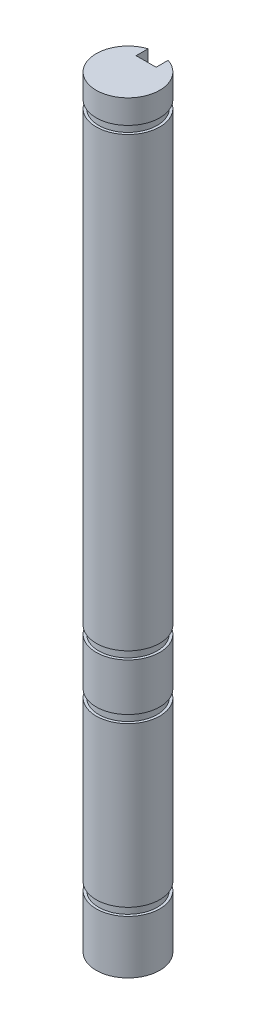
ISO-10303-21;
HEADER;
FILE_DESCRIPTION(('STEP AP214'),'2;1');
FILE_NAME('part.step','',(''),(''),'','','');
FILE_SCHEMA(('AUTOMOTIVE_DESIGN { 1 0 10303 214 1 1 1 1 }'));
ENDSEC;
DATA;
#1=APPLICATION_CONTEXT('core data for automotive mechanical design processes');
#2=APPLICATION_PROTOCOL_DEFINITION('international standard','automotive_design',2000,#1);
#3=PRODUCT_CONTEXT('',#1,'mechanical');
#4=PRODUCT('Part','Part','',(#3));
#5=PRODUCT_RELATED_PRODUCT_CATEGORY('part','',(#4));
#6=PRODUCT_DEFINITION_FORMATION('','',#4);
#7=PRODUCT_DEFINITION_CONTEXT('part definition',#1,'design');
#8=PRODUCT_DEFINITION('design','',#6,#7);
#9=PRODUCT_DEFINITION_SHAPE('','',#8);
#10=(LENGTH_UNIT() NAMED_UNIT(*) SI_UNIT(.MILLI.,.METRE.));
#11=(NAMED_UNIT(*) PLANE_ANGLE_UNIT() SI_UNIT($,.RADIAN.));
#12=(NAMED_UNIT(*) SI_UNIT($,.STERADIAN.) SOLID_ANGLE_UNIT());
#13=UNCERTAINTY_MEASURE_WITH_UNIT(LENGTH_MEASURE(1.E-05),#10,'distance_accuracy_value','');
#14=(GEOMETRIC_REPRESENTATION_CONTEXT(3) GLOBAL_UNCERTAINTY_ASSIGNED_CONTEXT((#13)) GLOBAL_UNIT_ASSIGNED_CONTEXT((#10,
#11,#12)) REPRESENTATION_CONTEXT('',''));
#15=CARTESIAN_POINT('',(0.,0.,0.));
#16=DIRECTION('',(0.,0.,1.));
#17=DIRECTION('',(1.,0.,0.));
#18=AXIS2_PLACEMENT_3D('',#15,#16,#17);
#19=CARTESIAN_POINT('',(0.,76.2,0.));
#20=DIRECTION('',(0.,-1.,0.));
#21=DIRECTION('',(0.,0.,-1.));
#22=AXIS2_PLACEMENT_3D('',#19,#20,#21);
#23=CYLINDRICAL_SURFACE('',#22,3.175);
#24=CARTESIAN_POINT('',(0.,6.1214,0.));
#25=DIRECTION('',(0.,-1.,0.));
#26=DIRECTION('',(0.,0.,-1.));
#27=AXIS2_PLACEMENT_3D('',#24,#25,#26);
#28=CIRCLE('',#27,3.175);
#29=CARTESIAN_POINT('',(0.999999999999999,6.1214,-3.01340753964677));
#30=VERTEX_POINT('',#29);
#31=CARTESIAN_POINT('',(-1.,6.1214,-3.01340753964677));
#32=VERTEX_POINT('',#31);
#33=EDGE_CURVE('E186',#30,#32,#28,.T.);
#34=ORIENTED_EDGE('',*,*,#33,.F.);
#35=DIRECTION('',(0.,-1.,0.));
#36=VECTOR('',#35,1.);
#37=CARTESIAN_POINT('',(1.,76.2,-3.01340753964677));
#38=LINE('',#37,#36);
#39=CARTESIAN_POINT('',(0.999999999999999,22.0218,-3.01340753964677));
#40=VERTEX_POINT('',#39);
#41=EDGE_CURVE('E323',#40,#30,#38,.T.);
#42=ORIENTED_EDGE('',*,*,#41,.F.);
#43=CARTESIAN_POINT('',(0.,22.0218,0.));
#44=DIRECTION('',(0.,-1.,0.));
#45=DIRECTION('',(0.,0.,-1.));
#46=AXIS2_PLACEMENT_3D('',#43,#44,#45);
#47=CIRCLE('',#46,3.175);
#48=CARTESIAN_POINT('',(-1.,22.0218,-3.01340753964677));
#49=VERTEX_POINT('',#48);
#50=EDGE_CURVE('E201',#40,#49,#47,.T.);
#51=ORIENTED_EDGE('',*,*,#50,.T.);
#52=DIRECTION('',(0.,-1.,0.));
#53=VECTOR('',#52,1.);
#54=CARTESIAN_POINT('',(-1.,76.2,-3.01340753964677));
#55=LINE('',#54,#53);
#56=EDGE_CURVE('E363',#49,#32,#55,.T.);
#57=ORIENTED_EDGE('',*,*,#56,.T.);
#58=EDGE_LOOP('',(#34,#42,#51,#57));
#59=FACE_BOUND('',#58,.T.);
#60=ADVANCED_FACE('F34',(#59),#23,.T.);
#61=CARTESIAN_POINT('',(0.,22.8092,0.));
#62=DIRECTION('',(0.,-1.,0.));
#63=DIRECTION('',(0.,0.,-1.));
#64=AXIS2_PLACEMENT_3D('',#61,#62,#63);
#65=CIRCLE('',#64,3.175);
#66=CARTESIAN_POINT('',(0.999999999999999,22.8092,-3.01340753964677));
#67=VERTEX_POINT('',#66);
#68=CARTESIAN_POINT('',(-1.,22.8092,-3.01340753964677));
#69=VERTEX_POINT('',#68);
#70=EDGE_CURVE('E199',#67,#69,#65,.T.);
#71=ORIENTED_EDGE('',*,*,#70,.F.);
#72=CARTESIAN_POINT('',(0.999999999999999,27.5336,-3.01340753964677));
#73=VERTEX_POINT('',#72);
#74=EDGE_CURVE('E324',#73,#67,#38,.T.);
#75=ORIENTED_EDGE('',*,*,#74,.F.);
#76=CARTESIAN_POINT('',(0.,27.5336,0.));
#77=DIRECTION('',(0.,-1.,0.));
#78=DIRECTION('',(0.,0.,-1.));
#79=AXIS2_PLACEMENT_3D('',#76,#77,#78);
#80=CIRCLE('',#79,3.175);
#81=CARTESIAN_POINT('',(-1.,27.5336,-3.01340753964677));
#82=VERTEX_POINT('',#81);
#83=EDGE_CURVE('E219',#73,#82,#80,.T.);
#84=ORIENTED_EDGE('',*,*,#83,.T.);
#85=EDGE_CURVE('E354',#82,#69,#55,.T.);
#86=ORIENTED_EDGE('',*,*,#85,.T.);
#87=EDGE_LOOP('',(#71,#75,#84,#86));
#88=FACE_BOUND('',#87,.T.);
#89=ADVANCED_FACE('F352',(#88),#23,.T.);
#90=CARTESIAN_POINT('',(0.,28.321,0.));
#91=DIRECTION('',(0.,-1.,0.));
#92=DIRECTION('',(0.,0.,-1.));
#93=AXIS2_PLACEMENT_3D('',#90,#91,#92);
#94=CIRCLE('',#93,3.175);
#95=CARTESIAN_POINT('',(0.999999999999999,28.321,-3.01340753964677));
#96=VERTEX_POINT('',#95);
#97=CARTESIAN_POINT('',(-1.,28.321,-3.01340753964677));
#98=VERTEX_POINT('',#97);
#99=EDGE_CURVE('E217',#96,#98,#94,.T.);
#100=ORIENTED_EDGE('',*,*,#99,.F.);
#101=CARTESIAN_POINT('',(0.999999999999999,73.025,-3.01340753964677));
#102=VERTEX_POINT('',#101);
#103=EDGE_CURVE('E285',#102,#96,#38,.T.);
#104=ORIENTED_EDGE('',*,*,#103,.F.);
#105=CARTESIAN_POINT('',(0.,73.025,0.));
#106=DIRECTION('',(0.,1.,0.));
#107=DIRECTION('',(0.,0.,1.));
#108=AXIS2_PLACEMENT_3D('',#105,#106,#107);
#109=CIRCLE('',#108,3.175);
#110=CARTESIAN_POINT('',(-1.,73.025,-3.01340753964677));
#111=VERTEX_POINT('',#110);
#112=EDGE_CURVE('E235',#111,#102,#109,.T.);
#113=ORIENTED_EDGE('',*,*,#112,.F.);
#114=EDGE_CURVE('E274',#111,#98,#55,.T.);
#115=ORIENTED_EDGE('',*,*,#114,.T.);
#116=EDGE_LOOP('',(#100,#104,#113,#115));
#117=FACE_BOUND('',#116,.T.);
#118=ADVANCED_FACE('F336',(#117),#23,.T.);
#119=CARTESIAN_POINT('',(0.999999999999999,5.334,-3.01340753964677));
#120=VERTEX_POINT('',#119);
#121=CARTESIAN_POINT('',(1.,0.,-3.01340753964677));
#122=VERTEX_POINT('',#121);
#123=EDGE_CURVE('E280',#120,#122,#38,.T.);
#124=ORIENTED_EDGE('',*,*,#123,.F.);
#125=CARTESIAN_POINT('',(0.,5.334,0.));
#126=DIRECTION('',(0.,-1.,0.));
#127=DIRECTION('',(0.,0.,-1.));
#128=AXIS2_PLACEMENT_3D('',#125,#126,#127);
#129=CIRCLE('',#128,3.175);
#130=CARTESIAN_POINT('',(-1.,5.334,-3.01340753964677));
#131=VERTEX_POINT('',#130);
#132=EDGE_CURVE('E176',#120,#131,#129,.T.);
#133=ORIENTED_EDGE('',*,*,#132,.T.);
#134=CARTESIAN_POINT('',(-1.,0.,-3.01340753964677));
#135=VERTEX_POINT('',#134);
#136=EDGE_CURVE('E261',#131,#135,#55,.T.);
#137=ORIENTED_EDGE('',*,*,#136,.T.);
#138=CARTESIAN_POINT('',(0.,0.,0.));
#139=DIRECTION('',(0.,1.,0.));
#140=DIRECTION('',(0.,0.,1.));
#141=AXIS2_PLACEMENT_3D('',#138,#139,#140);
#142=CIRCLE('',#141,3.175);
#143=EDGE_CURVE('E250',#135,#122,#142,.T.);
#144=ORIENTED_EDGE('',*,*,#143,.T.);
#145=EDGE_LOOP('',(#124,#133,#137,#144));
#146=FACE_BOUND('',#145,.T.);
#147=ADVANCED_FACE('F320',(#146),#23,.T.);
#148=CARTESIAN_POINT('',(-1.,76.2,-3.01340753964677));
#149=VERTEX_POINT('',#148);
#150=CARTESIAN_POINT('',(-1.,73.8124,-3.01340753964677));
#151=VERTEX_POINT('',#150);
#152=EDGE_CURVE('E270',#149,#151,#55,.T.);
#153=ORIENTED_EDGE('',*,*,#152,.T.);
#154=CARTESIAN_POINT('',(0.,73.8124,0.));
#155=DIRECTION('',(0.,1.,0.));
#156=DIRECTION('',(0.,0.,1.));
#157=AXIS2_PLACEMENT_3D('',#154,#155,#156);
#158=CIRCLE('',#157,3.175);
#159=CARTESIAN_POINT('',(0.999999999999999,73.8124,-3.01340753964677));
#160=VERTEX_POINT('',#159);
#161=EDGE_CURVE('E238',#151,#160,#158,.T.);
#162=ORIENTED_EDGE('',*,*,#161,.T.);
#163=CARTESIAN_POINT('',(1.,76.2,-3.01340753964677));
#164=VERTEX_POINT('',#163);
#165=EDGE_CURVE('E281',#164,#160,#38,.T.);
#166=ORIENTED_EDGE('',*,*,#165,.F.);
#167=CARTESIAN_POINT('',(0.,76.2,0.));
#168=DIRECTION('',(0.,1.,0.));
#169=DIRECTION('',(0.,0.,1.));
#170=AXIS2_PLACEMENT_3D('',#167,#168,#169);
#171=CIRCLE('',#170,3.175);
#172=EDGE_CURVE('E251',#149,#164,#171,.T.);
#173=ORIENTED_EDGE('',*,*,#172,.F.);
#174=EDGE_LOOP('',(#153,#162,#166,#173));
#175=FACE_BOUND('',#174,.T.);
#176=ADVANCED_FACE('F36',(#175),#23,.T.);
#177=CARTESIAN_POINT('',(1.,76.2,-1.81340753964677));
#178=DIRECTION('',(1.,0.,0.));
#179=DIRECTION('',(0.,0.,-1.));
#180=AXIS2_PLACEMENT_3D('',#177,#178,#179);
#181=PLANE('',#180);
#182=DIRECTION('',(0.,1.,0.));
#183=VECTOR('',#182,1.);
#184=CARTESIAN_POINT('',(0.999999999999999,5.334,-2.74449284932572));
#185=LINE('',#184,#183);
#186=CARTESIAN_POINT('',(1.,6.1214,-2.74449284932572));
#187=VERTEX_POINT('',#186);
#188=CARTESIAN_POINT('',(1.,5.334,-2.74449284932572));
#189=VERTEX_POINT('',#188);
#190=EDGE_CURVE('E183',#187,#189,#185,.F.);
#191=ORIENTED_EDGE('',*,*,#190,.T.);
#192=DIRECTION('',(0.,0.,-1.));
#193=VECTOR('',#192,1.);
#194=CARTESIAN_POINT('',(1.,5.334,-1.81340753964677));
#195=LINE('',#194,#193);
#196=EDGE_CURVE('E171',#189,#120,#195,.T.);
#197=ORIENTED_EDGE('',*,*,#196,.T.);
#198=ORIENTED_EDGE('',*,*,#123,.T.);
#199=DIRECTION('',(0.,0.,1.));
#200=VECTOR('',#199,1.);
#201=CARTESIAN_POINT('',(1.,0.,-1.81340753964677));
#202=LINE('',#201,#200);
#203=CARTESIAN_POINT('',(1.,0.,-1.81340753964677));
#204=VERTEX_POINT('',#203);
#205=EDGE_CURVE('E264',#122,#204,#202,.T.);
#206=ORIENTED_EDGE('',*,*,#205,.T.);
#207=DIRECTION('',(0.,-1.,0.));
#208=VECTOR('',#207,1.);
#209=CARTESIAN_POINT('',(1.,76.2,-1.81340753964677));
#210=LINE('',#209,#208);
#211=CARTESIAN_POINT('',(1.,76.2,-1.81340753964677));
#212=VERTEX_POINT('',#211);
#213=EDGE_CURVE('E277',#212,#204,#210,.T.);
#214=ORIENTED_EDGE('',*,*,#213,.F.);
#215=DIRECTION('',(0.,0.,1.));
#216=VECTOR('',#215,1.);
#217=CARTESIAN_POINT('',(1.,76.2,-1.81340753964677));
#218=LINE('',#217,#216);
#219=EDGE_CURVE('E254',#164,#212,#218,.T.);
#220=ORIENTED_EDGE('',*,*,#219,.F.);
#221=ORIENTED_EDGE('',*,*,#165,.T.);
#222=DIRECTION('',(0.,0.,1.));
#223=VECTOR('',#222,1.);
#224=CARTESIAN_POINT('',(1.,73.8124,-1.81340753964677));
#225=LINE('',#224,#223);
#226=CARTESIAN_POINT('',(1.,73.8124,-2.74449284932572));
#227=VERTEX_POINT('',#226);
#228=EDGE_CURVE('E247',#160,#227,#225,.T.);
#229=ORIENTED_EDGE('',*,*,#228,.T.);
#230=DIRECTION('',(0.,-1.,0.));
#231=VECTOR('',#230,1.);
#232=CARTESIAN_POINT('',(0.999999999999999,73.8124,-2.74449284932572));
#233=LINE('',#232,#231);
#234=CARTESIAN_POINT('',(1.,73.025,-2.74449284932572));
#235=VERTEX_POINT('',#234);
#236=EDGE_CURVE('E241',#227,#235,#233,.T.);
#237=ORIENTED_EDGE('',*,*,#236,.T.);
#238=DIRECTION('',(0.,0.,1.));
#239=VECTOR('',#238,1.);
#240=CARTESIAN_POINT('',(1.,73.025,-1.81340753964677));
#241=LINE('',#240,#239);
#242=EDGE_CURVE('E245',#102,#235,#241,.T.);
#243=ORIENTED_EDGE('',*,*,#242,.F.);
#244=ORIENTED_EDGE('',*,*,#103,.T.);
#245=DIRECTION('',(0.,0.,-1.));
#246=VECTOR('',#245,1.);
#247=CARTESIAN_POINT('',(1.,28.321,-1.81340753964677));
#248=LINE('',#247,#246);
#249=CARTESIAN_POINT('',(1.,28.321,-2.74449284932572));
#250=VERTEX_POINT('',#249);
#251=EDGE_CURVE('E226',#250,#96,#248,.T.);
#252=ORIENTED_EDGE('',*,*,#251,.F.);
#253=DIRECTION('',(0.,1.,0.));
#254=VECTOR('',#253,1.);
#255=CARTESIAN_POINT('',(0.999999999999999,27.5336,-2.74449284932572));
#256=LINE('',#255,#254);
#257=CARTESIAN_POINT('',(1.,27.5336,-2.74449284932572));
#258=VERTEX_POINT('',#257);
#259=EDGE_CURVE('E222',#250,#258,#256,.F.);
#260=ORIENTED_EDGE('',*,*,#259,.T.);
#261=DIRECTION('',(0.,0.,-1.));
#262=VECTOR('',#261,1.);
#263=CARTESIAN_POINT('',(1.,27.5336,-1.81340753964677));
#264=LINE('',#263,#262);
#265=EDGE_CURVE('E228',#258,#73,#264,.T.);
#266=ORIENTED_EDGE('',*,*,#265,.T.);
#267=ORIENTED_EDGE('',*,*,#74,.T.);
#268=DIRECTION('',(0.,0.,-1.));
#269=VECTOR('',#268,1.);
#270=CARTESIAN_POINT('',(1.,22.8092,-1.81340753964677));
#271=LINE('',#270,#269);
#272=CARTESIAN_POINT('',(1.,22.8092,-2.74449284932572));
#273=VERTEX_POINT('',#272);
#274=EDGE_CURVE('E208',#273,#67,#271,.T.);
#275=ORIENTED_EDGE('',*,*,#274,.F.);
#276=DIRECTION('',(0.,1.,0.));
#277=VECTOR('',#276,1.);
#278=CARTESIAN_POINT('',(0.999999999999999,22.0218,-2.74449284932572));
#279=LINE('',#278,#277);
#280=CARTESIAN_POINT('',(1.,22.0218,-2.74449284932572));
#281=VERTEX_POINT('',#280);
#282=EDGE_CURVE('E204',#273,#281,#279,.F.);
#283=ORIENTED_EDGE('',*,*,#282,.T.);
#284=DIRECTION('',(0.,0.,-1.));
#285=VECTOR('',#284,1.);
#286=CARTESIAN_POINT('',(1.,22.0218,-1.81340753964677));
#287=LINE('',#286,#285);
#288=EDGE_CURVE('E210',#281,#40,#287,.T.);
#289=ORIENTED_EDGE('',*,*,#288,.T.);
#290=ORIENTED_EDGE('',*,*,#41,.T.);
#291=DIRECTION('',(0.,0.,-1.));
#292=VECTOR('',#291,1.);
#293=CARTESIAN_POINT('',(1.,6.1214,-1.81340753964677));
#294=LINE('',#293,#292);
#295=EDGE_CURVE('E180',#187,#30,#294,.T.);
#296=ORIENTED_EDGE('',*,*,#295,.F.);
#297=EDGE_LOOP('',(#191,#197,#198,#206,#214,#220,#221,#229,#237,#243,#244,#252,#260,#266,#267,
#275,#283,#289,#290,#296));
#298=FACE_BOUND('',#297,.T.);
#299=ADVANCED_FACE('F189',(#298),#181,.F.);
#300=CARTESIAN_POINT('',(-1.,76.2,-1.81340753964677));
#301=DIRECTION('',(0.,0.,1.));
#302=DIRECTION('',(1.,0.,0.));
#303=AXIS2_PLACEMENT_3D('',#300,#301,#302);
#304=PLANE('',#303);
#305=DIRECTION('',(-1.,0.,0.));
#306=VECTOR('',#305,1.);
#307=CARTESIAN_POINT('',(-1.,0.,-1.81340753964677));
#308=LINE('',#307,#306);
#309=CARTESIAN_POINT('',(-1.,0.,-1.81340753964677));
#310=VERTEX_POINT('',#309);
#311=EDGE_CURVE('E266',#204,#310,#308,.T.);
#312=ORIENTED_EDGE('',*,*,#311,.T.);
#313=DIRECTION('',(0.,-1.,0.));
#314=VECTOR('',#313,1.);
#315=CARTESIAN_POINT('',(-1.,76.2,-1.81340753964677));
#316=LINE('',#315,#314);
#317=CARTESIAN_POINT('',(-1.,76.2,-1.81340753964677));
#318=VERTEX_POINT('',#317);
#319=EDGE_CURVE('E273',#318,#310,#316,.T.);
#320=ORIENTED_EDGE('',*,*,#319,.F.);
#321=DIRECTION('',(-1.,0.,0.));
#322=VECTOR('',#321,1.);
#323=CARTESIAN_POINT('',(-1.,76.2,-1.81340753964677));
#324=LINE('',#323,#322);
#325=EDGE_CURVE('E257',#212,#318,#324,.T.);
#326=ORIENTED_EDGE('',*,*,#325,.F.);
#327=ORIENTED_EDGE('',*,*,#213,.T.);
#328=EDGE_LOOP('',(#312,#320,#326,#327));
#329=FACE_BOUND('',#328,.T.);
#330=ADVANCED_FACE('F374',(#329),#304,.F.);
#331=CARTESIAN_POINT('',(-1.,76.2,-3.01340753964677));
#332=DIRECTION('',(-1.,0.,0.));
#333=DIRECTION('',(0.,0.,1.));
#334=AXIS2_PLACEMENT_3D('',#331,#332,#333);
#335=PLANE('',#334);
#336=ORIENTED_EDGE('',*,*,#136,.F.);
#337=DIRECTION('',(0.,0.,1.));
#338=VECTOR('',#337,1.);
#339=CARTESIAN_POINT('',(-1.,5.334,-3.01340753964677));
#340=LINE('',#339,#338);
#341=CARTESIAN_POINT('',(-1.,5.334,-2.74449284932572));
#342=VERTEX_POINT('',#341);
#343=EDGE_CURVE('E11',#131,#342,#340,.T.);
#344=ORIENTED_EDGE('',*,*,#343,.T.);
#345=DIRECTION('',(0.,1.,0.));
#346=VECTOR('',#345,1.);
#347=CARTESIAN_POINT('',(-1.,5.334,-2.74449284932572));
#348=LINE('',#347,#346);
#349=CARTESIAN_POINT('',(-1.,6.1214,-2.74449284932572));
#350=VERTEX_POINT('',#349);
#351=EDGE_CURVE('E185',#342,#350,#348,.T.);
#352=ORIENTED_EDGE('',*,*,#351,.T.);
#353=DIRECTION('',(0.,0.,1.));
#354=VECTOR('',#353,1.);
#355=CARTESIAN_POINT('',(-1.,6.1214,-3.01340753964677));
#356=LINE('',#355,#354);
#357=EDGE_CURVE('E42',#32,#350,#356,.T.);
#358=ORIENTED_EDGE('',*,*,#357,.F.);
#359=ORIENTED_EDGE('',*,*,#56,.F.);
#360=DIRECTION('',(0.,0.,1.));
#361=VECTOR('',#360,1.);
#362=CARTESIAN_POINT('',(-1.,22.0218,-3.01340753964677));
#363=LINE('',#362,#361);
#364=CARTESIAN_POINT('',(-1.,22.0218,-2.74449284932572));
#365=VERTEX_POINT('',#364);
#366=EDGE_CURVE('E307',#49,#365,#363,.T.);
#367=ORIENTED_EDGE('',*,*,#366,.T.);
#368=DIRECTION('',(0.,1.,0.));
#369=VECTOR('',#368,1.);
#370=CARTESIAN_POINT('',(-1.,22.0218,-2.74449284932572));
#371=LINE('',#370,#369);
#372=CARTESIAN_POINT('',(-1.,22.8092,-2.74449284932572));
#373=VERTEX_POINT('',#372);
#374=EDGE_CURVE('E302',#365,#373,#371,.T.);
#375=ORIENTED_EDGE('',*,*,#374,.T.);
#376=DIRECTION('',(0.,0.,1.));
#377=VECTOR('',#376,1.);
#378=CARTESIAN_POINT('',(-1.,22.8092,-3.01340753964677));
#379=LINE('',#378,#377);
#380=EDGE_CURVE('E305',#69,#373,#379,.T.);
#381=ORIENTED_EDGE('',*,*,#380,.F.);
#382=ORIENTED_EDGE('',*,*,#85,.F.);
#383=DIRECTION('',(0.,0.,1.));
#384=VECTOR('',#383,1.);
#385=CARTESIAN_POINT('',(-1.,27.5336,-3.01340753964677));
#386=LINE('',#385,#384);
#387=CARTESIAN_POINT('',(-1.,27.5336,-2.74449284932572));
#388=VERTEX_POINT('',#387);
#389=EDGE_CURVE('E299',#82,#388,#386,.T.);
#390=ORIENTED_EDGE('',*,*,#389,.T.);
#391=DIRECTION('',(0.,1.,0.));
#392=VECTOR('',#391,1.);
#393=CARTESIAN_POINT('',(-1.,27.5336,-2.74449284932572));
#394=LINE('',#393,#392);
#395=CARTESIAN_POINT('',(-1.,28.321,-2.74449284932572));
#396=VERTEX_POINT('',#395);
#397=EDGE_CURVE('E293',#388,#396,#394,.T.);
#398=ORIENTED_EDGE('',*,*,#397,.T.);
#399=DIRECTION('',(0.,0.,1.));
#400=VECTOR('',#399,1.);
#401=CARTESIAN_POINT('',(-1.,28.321,-3.01340753964677));
#402=LINE('',#401,#400);
#403=EDGE_CURVE('E296',#98,#396,#402,.T.);
#404=ORIENTED_EDGE('',*,*,#403,.F.);
#405=ORIENTED_EDGE('',*,*,#114,.F.);
#406=DIRECTION('',(0.,0.,-1.));
#407=VECTOR('',#406,1.);
#408=CARTESIAN_POINT('',(-1.,73.025,-3.01340753964677));
#409=LINE('',#408,#407);
#410=CARTESIAN_POINT('',(-1.,73.025,-2.74449284932572));
#411=VERTEX_POINT('',#410);
#412=EDGE_CURVE('E288',#411,#111,#409,.T.);
#413=ORIENTED_EDGE('',*,*,#412,.F.);
#414=DIRECTION('',(0.,-1.,0.));
#415=VECTOR('',#414,1.);
#416=CARTESIAN_POINT('',(-1.,73.8124,-2.74449284932572));
#417=LINE('',#416,#415);
#418=CARTESIAN_POINT('',(-1.,73.8124,-2.74449284932572));
#419=VERTEX_POINT('',#418);
#420=EDGE_CURVE('E284',#411,#419,#417,.F.);
#421=ORIENTED_EDGE('',*,*,#420,.T.);
#422=DIRECTION('',(0.,0.,-1.));
#423=VECTOR('',#422,1.);
#424=CARTESIAN_POINT('',(-1.,73.8124,-3.01340753964677));
#425=LINE('',#424,#423);
#426=EDGE_CURVE('E290',#419,#151,#425,.T.);
#427=ORIENTED_EDGE('',*,*,#426,.T.);
#428=ORIENTED_EDGE('',*,*,#152,.F.);
#429=DIRECTION('',(0.,0.,-1.));
#430=VECTOR('',#429,1.);
#431=CARTESIAN_POINT('',(-1.,76.2,-3.01340753964677));
#432=LINE('',#431,#430);
#433=EDGE_CURVE('E259',#318,#149,#432,.T.);
#434=ORIENTED_EDGE('',*,*,#433,.F.);
#435=ORIENTED_EDGE('',*,*,#319,.T.);
#436=DIRECTION('',(0.,0.,-1.));
#437=VECTOR('',#436,1.);
#438=CARTESIAN_POINT('',(-1.,0.,-3.01340753964677));
#439=LINE('',#438,#437);
#440=EDGE_CURVE('E255',#310,#135,#439,.T.);
#441=ORIENTED_EDGE('',*,*,#440,.T.);
#442=EDGE_LOOP('',(#336,#344,#352,#358,#359,#367,#375,#381,#382,#390,#398,#404,#405,#413,#421,
#427,#428,#434,#435,#441));
#443=FACE_BOUND('',#442,.T.);
#444=ADVANCED_FACE('F318',(#443),#335,.F.);
#445=CARTESIAN_POINT('',(0.,76.2,0.));
#446=DIRECTION('',(0.,1.,0.));
#447=DIRECTION('',(0.,0.,1.));
#448=AXIS2_PLACEMENT_3D('',#445,#446,#447);
#449=PLANE('',#448);
#450=ORIENTED_EDGE('',*,*,#172,.T.);
#451=ORIENTED_EDGE('',*,*,#219,.T.);
#452=ORIENTED_EDGE('',*,*,#325,.T.);
#453=ORIENTED_EDGE('',*,*,#433,.T.);
#454=EDGE_LOOP('',(#450,#451,#452,#453));
#455=FACE_BOUND('',#454,.T.);
#456=ADVANCED_FACE('F385',(#455),#449,.T.);
#457=CARTESIAN_POINT('',(0.,0.,0.));
#458=DIRECTION('',(0.,1.,0.));
#459=DIRECTION('',(0.,0.,1.));
#460=AXIS2_PLACEMENT_3D('',#457,#458,#459);
#461=PLANE('',#460);
#462=ORIENTED_EDGE('',*,*,#143,.F.);
#463=ORIENTED_EDGE('',*,*,#440,.F.);
#464=ORIENTED_EDGE('',*,*,#311,.F.);
#465=ORIENTED_EDGE('',*,*,#205,.F.);
#466=EDGE_LOOP('',(#462,#463,#464,#465));
#467=FACE_BOUND('',#466,.T.);
#468=ADVANCED_FACE('F391',(#467),#461,.F.);
#469=CARTESIAN_POINT('',(0.,73.8124,0.));
#470=DIRECTION('',(0.,1.,0.));
#471=DIRECTION('',(0.,0.,1.));
#472=AXIS2_PLACEMENT_3D('',#469,#470,#471);
#473=PLANE('',#472);
#474=ORIENTED_EDGE('',*,*,#161,.F.);
#475=ORIENTED_EDGE('',*,*,#426,.F.);
#476=CARTESIAN_POINT('',(0.,73.8124,0.));
#477=DIRECTION('',(0.,1.,0.));
#478=DIRECTION('',(0.,0.,1.));
#479=AXIS2_PLACEMENT_3D('',#476,#477,#478);
#480=CIRCLE('',#479,2.921);
#481=EDGE_CURVE('E232',#419,#227,#480,.T.);
#482=ORIENTED_EDGE('',*,*,#481,.T.);
#483=ORIENTED_EDGE('',*,*,#228,.F.);
#484=EDGE_LOOP('',(#474,#475,#482,#483));
#485=FACE_BOUND('',#484,.T.);
#486=ADVANCED_FACE('F381',(#485),#473,.F.);
#487=CARTESIAN_POINT('',(0.,73.025,0.));
#488=DIRECTION('',(0.,1.,0.));
#489=DIRECTION('',(0.,0.,1.));
#490=AXIS2_PLACEMENT_3D('',#487,#488,#489);
#491=PLANE('',#490);
#492=ORIENTED_EDGE('',*,*,#242,.T.);
#493=CARTESIAN_POINT('',(0.,73.025,0.));
#494=DIRECTION('',(0.,1.,0.));
#495=DIRECTION('',(0.,0.,1.));
#496=AXIS2_PLACEMENT_3D('',#493,#494,#495);
#497=CIRCLE('',#496,2.921);
#498=EDGE_CURVE('E231',#411,#235,#497,.T.);
#499=ORIENTED_EDGE('',*,*,#498,.F.);
#500=ORIENTED_EDGE('',*,*,#412,.T.);
#501=ORIENTED_EDGE('',*,*,#112,.T.);
#502=EDGE_LOOP('',(#492,#499,#500,#501));
#503=FACE_BOUND('',#502,.T.);
#504=ADVANCED_FACE('F398',(#503),#491,.T.);
#505=CARTESIAN_POINT('',(0.,73.8124,0.));
#506=DIRECTION('',(0.,-1.,0.));
#507=DIRECTION('',(0.,0.,-1.));
#508=AXIS2_PLACEMENT_3D('',#505,#506,#507);
#509=CYLINDRICAL_SURFACE('',#508,2.921);
#510=ORIENTED_EDGE('',*,*,#481,.F.);
#511=ORIENTED_EDGE('',*,*,#420,.F.);
#512=ORIENTED_EDGE('',*,*,#498,.T.);
#513=ORIENTED_EDGE('',*,*,#236,.F.);
#514=EDGE_LOOP('',(#510,#511,#512,#513));
#515=FACE_BOUND('',#514,.T.);
#516=ADVANCED_FACE('F444',(#515),#509,.T.);
#517=CARTESIAN_POINT('',(0.,27.5336,0.));
#518=DIRECTION('',(0.,-1.,0.));
#519=DIRECTION('',(0.,0.,-1.));
#520=AXIS2_PLACEMENT_3D('',#517,#518,#519);
#521=PLANE('',#520);
#522=CARTESIAN_POINT('',(0.,27.5336,0.));
#523=DIRECTION('',(0.,-1.,0.));
#524=DIRECTION('',(0.,0.,-1.));
#525=AXIS2_PLACEMENT_3D('',#522,#523,#524);
#526=CIRCLE('',#525,2.921);
#527=EDGE_CURVE('E214',#258,#388,#526,.T.);
#528=ORIENTED_EDGE('',*,*,#527,.T.);
#529=ORIENTED_EDGE('',*,*,#389,.F.);
#530=ORIENTED_EDGE('',*,*,#83,.F.);
#531=ORIENTED_EDGE('',*,*,#265,.F.);
#532=EDGE_LOOP('',(#528,#529,#530,#531));
#533=FACE_BOUND('',#532,.T.);
#534=ADVANCED_FACE('F349',(#533),#521,.F.);
#535=CARTESIAN_POINT('',(0.,28.321,0.));
#536=DIRECTION('',(0.,-1.,0.));
#537=DIRECTION('',(0.,0.,-1.));
#538=AXIS2_PLACEMENT_3D('',#535,#536,#537);
#539=PLANE('',#538);
#540=ORIENTED_EDGE('',*,*,#251,.T.);
#541=ORIENTED_EDGE('',*,*,#99,.T.);
#542=ORIENTED_EDGE('',*,*,#403,.T.);
#543=CARTESIAN_POINT('',(0.,28.321,0.));
#544=DIRECTION('',(0.,-1.,0.));
#545=DIRECTION('',(0.,0.,-1.));
#546=AXIS2_PLACEMENT_3D('',#543,#544,#545);
#547=CIRCLE('',#546,2.921);
#548=EDGE_CURVE('E213',#250,#396,#547,.T.);
#549=ORIENTED_EDGE('',*,*,#548,.F.);
#550=EDGE_LOOP('',(#540,#541,#542,#549));
#551=FACE_BOUND('',#550,.T.);
#552=ADVANCED_FACE('F341',(#551),#539,.T.);
#553=CARTESIAN_POINT('',(0.,27.5336,0.));
#554=DIRECTION('',(0.,1.,0.));
#555=DIRECTION('',(0.,0.,1.));
#556=AXIS2_PLACEMENT_3D('',#553,#554,#555);
#557=CYLINDRICAL_SURFACE('',#556,2.921);
#558=ORIENTED_EDGE('',*,*,#548,.T.);
#559=ORIENTED_EDGE('',*,*,#397,.F.);
#560=ORIENTED_EDGE('',*,*,#527,.F.);
#561=ORIENTED_EDGE('',*,*,#259,.F.);
#562=EDGE_LOOP('',(#558,#559,#560,#561));
#563=FACE_BOUND('',#562,.T.);
#564=ADVANCED_FACE('F347',(#563),#557,.T.);
#565=CARTESIAN_POINT('',(0.,22.0218,0.));
#566=DIRECTION('',(0.,-1.,0.));
#567=DIRECTION('',(0.,0.,-1.));
#568=AXIS2_PLACEMENT_3D('',#565,#566,#567);
#569=PLANE('',#568);
#570=CARTESIAN_POINT('',(0.,22.0218,0.));
#571=DIRECTION('',(0.,-1.,0.));
#572=DIRECTION('',(0.,0.,-1.));
#573=AXIS2_PLACEMENT_3D('',#570,#571,#572);
#574=CIRCLE('',#573,2.921);
#575=EDGE_CURVE('E196',#281,#365,#574,.T.);
#576=ORIENTED_EDGE('',*,*,#575,.T.);
#577=ORIENTED_EDGE('',*,*,#366,.F.);
#578=ORIENTED_EDGE('',*,*,#50,.F.);
#579=ORIENTED_EDGE('',*,*,#288,.F.);
#580=EDGE_LOOP('',(#576,#577,#578,#579));
#581=FACE_BOUND('',#580,.T.);
#582=ADVANCED_FACE('F361',(#581),#569,.F.);
#583=CARTESIAN_POINT('',(0.,22.8092,0.));
#584=DIRECTION('',(0.,-1.,0.));
#585=DIRECTION('',(0.,0.,-1.));
#586=AXIS2_PLACEMENT_3D('',#583,#584,#585);
#587=PLANE('',#586);
#588=ORIENTED_EDGE('',*,*,#274,.T.);
#589=ORIENTED_EDGE('',*,*,#70,.T.);
#590=ORIENTED_EDGE('',*,*,#380,.T.);
#591=CARTESIAN_POINT('',(0.,22.8092,0.));
#592=DIRECTION('',(0.,-1.,0.));
#593=DIRECTION('',(0.,0.,-1.));
#594=AXIS2_PLACEMENT_3D('',#591,#592,#593);
#595=CIRCLE('',#594,2.921);
#596=EDGE_CURVE('E57',#273,#373,#595,.T.);
#597=ORIENTED_EDGE('',*,*,#596,.F.);
#598=EDGE_LOOP('',(#588,#589,#590,#597));
#599=FACE_BOUND('',#598,.T.);
#600=ADVANCED_FACE('F357',(#599),#587,.T.);
#601=CARTESIAN_POINT('',(0.,22.0218,0.));
#602=DIRECTION('',(0.,1.,0.));
#603=DIRECTION('',(0.,0.,1.));
#604=AXIS2_PLACEMENT_3D('',#601,#602,#603);
#605=CYLINDRICAL_SURFACE('',#604,2.921);
#606=ORIENTED_EDGE('',*,*,#596,.T.);
#607=ORIENTED_EDGE('',*,*,#374,.F.);
#608=ORIENTED_EDGE('',*,*,#575,.F.);
#609=ORIENTED_EDGE('',*,*,#282,.F.);
#610=EDGE_LOOP('',(#606,#607,#608,#609));
#611=FACE_BOUND('',#610,.T.);
#612=ADVANCED_FACE('F359',(#611),#605,.T.);
#613=CARTESIAN_POINT('',(0.,5.334,0.));
#614=DIRECTION('',(0.,-1.,0.));
#615=DIRECTION('',(0.,0.,-1.));
#616=AXIS2_PLACEMENT_3D('',#613,#614,#615);
#617=PLANE('',#616);
#618=CARTESIAN_POINT('',(0.,5.334,0.));
#619=DIRECTION('',(0.,-1.,0.));
#620=DIRECTION('',(0.,0.,-1.));
#621=AXIS2_PLACEMENT_3D('',#618,#619,#620);
#622=CIRCLE('',#621,2.921);
#623=EDGE_CURVE('E174',#189,#342,#622,.T.);
#624=ORIENTED_EDGE('',*,*,#623,.T.);
#625=ORIENTED_EDGE('',*,*,#343,.F.);
#626=ORIENTED_EDGE('',*,*,#132,.F.);
#627=ORIENTED_EDGE('',*,*,#196,.F.);
#628=EDGE_LOOP('',(#624,#625,#626,#627));
#629=FACE_BOUND('',#628,.T.);
#630=ADVANCED_FACE('F173',(#629),#617,.F.);
#631=CARTESIAN_POINT('',(0.,6.1214,0.));
#632=DIRECTION('',(0.,-1.,0.));
#633=DIRECTION('',(0.,0.,-1.));
#634=AXIS2_PLACEMENT_3D('',#631,#632,#633);
#635=PLANE('',#634);
#636=ORIENTED_EDGE('',*,*,#295,.T.);
#637=ORIENTED_EDGE('',*,*,#33,.T.);
#638=ORIENTED_EDGE('',*,*,#357,.T.);
#639=CARTESIAN_POINT('',(0.,6.1214,0.));
#640=DIRECTION('',(0.,-1.,0.));
#641=DIRECTION('',(0.,0.,-1.));
#642=AXIS2_PLACEMENT_3D('',#639,#640,#641);
#643=CIRCLE('',#642,2.921);
#644=EDGE_CURVE('E49',#187,#350,#643,.T.);
#645=ORIENTED_EDGE('',*,*,#644,.F.);
#646=EDGE_LOOP('',(#636,#637,#638,#645));
#647=FACE_BOUND('',#646,.T.);
#648=ADVANCED_FACE('F312',(#647),#635,.T.);
#649=CARTESIAN_POINT('',(0.,5.334,0.));
#650=DIRECTION('',(0.,1.,0.));
#651=DIRECTION('',(0.,0.,1.));
#652=AXIS2_PLACEMENT_3D('',#649,#650,#651);
#653=CYLINDRICAL_SURFACE('',#652,2.921);
#654=ORIENTED_EDGE('',*,*,#644,.T.);
#655=ORIENTED_EDGE('',*,*,#351,.F.);
#656=ORIENTED_EDGE('',*,*,#623,.F.);
#657=ORIENTED_EDGE('',*,*,#190,.F.);
#658=EDGE_LOOP('',(#654,#655,#656,#657));
#659=FACE_BOUND('',#658,.T.);
#660=ADVANCED_FACE('F182',(#659),#653,.T.);
#661=CLOSED_SHELL('',(#60,#89,#118,#147,#176,#299,#330,#444,#456,#468,#486,#504,#516,#534,#552,
#564,#582,#600,#612,#630,#648,#660));
#662=MANIFOLD_SOLID_BREP('B2',#661);
#663=ADVANCED_BREP_SHAPE_REPRESENTATION('',(#18,#662),#14);
#664=SHAPE_DEFINITION_REPRESENTATION(#9,#663);
ENDSEC;
END-ISO-10303-21;
